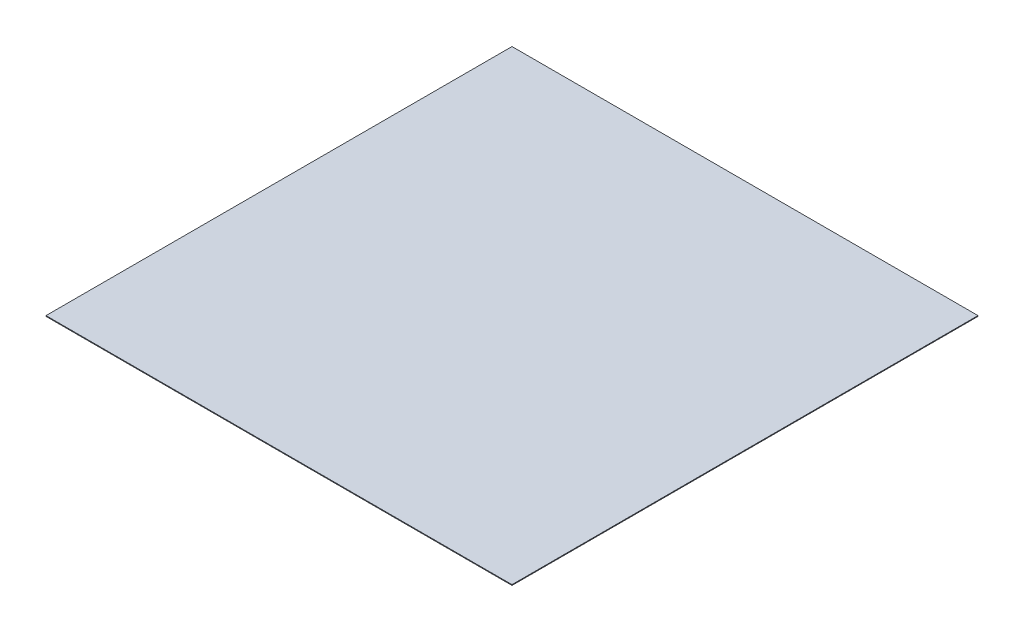
ISO-10303-21;
HEADER;
FILE_DESCRIPTION(('STEP AP214'),'2;1');
FILE_NAME('part.step','',(''),(''),'','','');
FILE_SCHEMA(('AUTOMOTIVE_DESIGN { 1 0 10303 214 1 1 1 1 }'));
ENDSEC;
DATA;
#1=APPLICATION_CONTEXT('core data for automotive mechanical design processes');
#2=APPLICATION_PROTOCOL_DEFINITION('international standard','automotive_design',2000,#1);
#3=PRODUCT_CONTEXT('',#1,'mechanical');
#4=PRODUCT('Part','Part','',(#3));
#5=PRODUCT_RELATED_PRODUCT_CATEGORY('part','',(#4));
#6=PRODUCT_DEFINITION_FORMATION('','',#4);
#7=PRODUCT_DEFINITION_CONTEXT('part definition',#1,'design');
#8=PRODUCT_DEFINITION('design','',#6,#7);
#9=PRODUCT_DEFINITION_SHAPE('','',#8);
#10=(LENGTH_UNIT() NAMED_UNIT(*) SI_UNIT(.MILLI.,.METRE.));
#11=(NAMED_UNIT(*) PLANE_ANGLE_UNIT() SI_UNIT($,.RADIAN.));
#12=(NAMED_UNIT(*) SI_UNIT($,.STERADIAN.) SOLID_ANGLE_UNIT());
#13=UNCERTAINTY_MEASURE_WITH_UNIT(LENGTH_MEASURE(1.E-05),#10,'distance_accuracy_value','');
#14=(GEOMETRIC_REPRESENTATION_CONTEXT(3) GLOBAL_UNCERTAINTY_ASSIGNED_CONTEXT((#13)) GLOBAL_UNIT_ASSIGNED_CONTEXT((#10,
#11,#12)) REPRESENTATION_CONTEXT('',''));
#15=CARTESIAN_POINT('',(0.,0.,0.));
#16=DIRECTION('',(0.,0.,1.));
#17=DIRECTION('',(1.,0.,0.));
#18=AXIS2_PLACEMENT_3D('',#15,#16,#17);
#19=CARTESIAN_POINT('',(0.,0.5,0.));
#20=DIRECTION('',(1.,0.,0.));
#21=DIRECTION('',(0.,0.,-1.));
#22=AXIS2_PLACEMENT_3D('',#19,#20,#21);
#23=PLANE('',#22);
#24=DIRECTION('',(0.,0.,1.));
#25=VECTOR('',#24,1.);
#26=CARTESIAN_POINT('',(0.,0.,0.));
#27=LINE('',#26,#25);
#28=CARTESIAN_POINT('',(0.,0.,-320.));
#29=VERTEX_POINT('',#28);
#30=CARTESIAN_POINT('',(0.,0.,0.));
#31=VERTEX_POINT('',#30);
#32=EDGE_CURVE('E98',#29,#31,#27,.T.);
#33=ORIENTED_EDGE('',*,*,#32,.T.);
#34=DIRECTION('',(0.,-1.,0.));
#35=VECTOR('',#34,1.);
#36=CARTESIAN_POINT('',(0.,0.5,0.));
#37=LINE('',#36,#35);
#38=CARTESIAN_POINT('',(0.,0.5,0.));
#39=VERTEX_POINT('',#38);
#40=EDGE_CURVE('E11',#39,#31,#37,.T.);
#41=ORIENTED_EDGE('',*,*,#40,.F.);
#42=DIRECTION('',(0.,0.,1.));
#43=VECTOR('',#42,1.);
#44=CARTESIAN_POINT('',(0.,0.5,0.));
#45=LINE('',#44,#43);
#46=CARTESIAN_POINT('',(0.,0.5,-320.));
#47=VERTEX_POINT('',#46);
#48=EDGE_CURVE('E86',#47,#39,#45,.T.);
#49=ORIENTED_EDGE('',*,*,#48,.F.);
#50=DIRECTION('',(0.,-1.,0.));
#51=VECTOR('',#50,1.);
#52=CARTESIAN_POINT('',(0.,0.5,-320.));
#53=LINE('',#52,#51);
#54=EDGE_CURVE('E94',#47,#29,#53,.T.);
#55=ORIENTED_EDGE('',*,*,#54,.T.);
#56=EDGE_LOOP('',(#33,#41,#49,#55));
#57=FACE_BOUND('',#56,.T.);
#58=ADVANCED_FACE('F35',(#57),#23,.F.);
#59=CARTESIAN_POINT('',(0.,0.5,0.));
#60=DIRECTION('',(0.,0.,-1.));
#61=DIRECTION('',(-1.,0.,0.));
#62=AXIS2_PLACEMENT_3D('',#59,#60,#61);
#63=PLANE('',#62);
#64=DIRECTION('',(1.,0.,0.));
#65=VECTOR('',#64,1.);
#66=CARTESIAN_POINT('',(0.,0.,0.));
#67=LINE('',#66,#65);
#68=CARTESIAN_POINT('',(320.,0.,0.));
#69=VERTEX_POINT('',#68);
#70=EDGE_CURVE('E90',#31,#69,#67,.T.);
#71=ORIENTED_EDGE('',*,*,#70,.T.);
#72=DIRECTION('',(0.,-1.,0.));
#73=VECTOR('',#72,1.);
#74=CARTESIAN_POINT('',(320.,0.5,0.));
#75=LINE('',#74,#73);
#76=CARTESIAN_POINT('',(320.,0.5,0.));
#77=VERTEX_POINT('',#76);
#78=EDGE_CURVE('E43',#77,#69,#75,.T.);
#79=ORIENTED_EDGE('',*,*,#78,.F.);
#80=DIRECTION('',(1.,0.,0.));
#81=VECTOR('',#80,1.);
#82=CARTESIAN_POINT('',(0.,0.5,0.));
#83=LINE('',#82,#81);
#84=EDGE_CURVE('E81',#39,#77,#83,.T.);
#85=ORIENTED_EDGE('',*,*,#84,.F.);
#86=ORIENTED_EDGE('',*,*,#40,.T.);
#87=EDGE_LOOP('',(#71,#79,#85,#86));
#88=FACE_BOUND('',#87,.T.);
#89=ADVANCED_FACE('F89',(#88),#63,.F.);
#90=CARTESIAN_POINT('',(320.,0.5,0.));
#91=DIRECTION('',(-1.,0.,0.));
#92=DIRECTION('',(0.,0.,1.));
#93=AXIS2_PLACEMENT_3D('',#90,#91,#92);
#94=PLANE('',#93);
#95=DIRECTION('',(0.,0.,-1.));
#96=VECTOR('',#95,1.);
#97=CARTESIAN_POINT('',(320.,0.,0.));
#98=LINE('',#97,#96);
#99=CARTESIAN_POINT('',(320.,0.,-320.));
#100=VERTEX_POINT('',#99);
#101=EDGE_CURVE('E68',#69,#100,#98,.T.);
#102=ORIENTED_EDGE('',*,*,#101,.T.);
#103=DIRECTION('',(0.,-1.,0.));
#104=VECTOR('',#103,1.);
#105=CARTESIAN_POINT('',(320.,0.5,-320.));
#106=LINE('',#105,#104);
#107=CARTESIAN_POINT('',(320.,0.5,-320.));
#108=VERTEX_POINT('',#107);
#109=EDGE_CURVE('E91',#108,#100,#106,.T.);
#110=ORIENTED_EDGE('',*,*,#109,.F.);
#111=DIRECTION('',(0.,0.,-1.));
#112=VECTOR('',#111,1.);
#113=CARTESIAN_POINT('',(320.,0.5,0.));
#114=LINE('',#113,#112);
#115=EDGE_CURVE('E84',#77,#108,#114,.T.);
#116=ORIENTED_EDGE('',*,*,#115,.F.);
#117=ORIENTED_EDGE('',*,*,#78,.T.);
#118=EDGE_LOOP('',(#102,#110,#116,#117));
#119=FACE_BOUND('',#118,.T.);
#120=ADVANCED_FACE('F92',(#119),#94,.F.);
#121=CARTESIAN_POINT('',(0.,0.5,-320.));
#122=DIRECTION('',(0.,0.,1.));
#123=DIRECTION('',(1.,0.,0.));
#124=AXIS2_PLACEMENT_3D('',#121,#122,#123);
#125=PLANE('',#124);
#126=DIRECTION('',(-1.,0.,0.));
#127=VECTOR('',#126,1.);
#128=CARTESIAN_POINT('',(0.,0.,-320.));
#129=LINE('',#128,#127);
#130=EDGE_CURVE('E74',#100,#29,#129,.T.);
#131=ORIENTED_EDGE('',*,*,#130,.T.);
#132=ORIENTED_EDGE('',*,*,#54,.F.);
#133=DIRECTION('',(-1.,0.,0.));
#134=VECTOR('',#133,1.);
#135=CARTESIAN_POINT('',(0.,0.5,-320.));
#136=LINE('',#135,#134);
#137=EDGE_CURVE('E51',#108,#47,#136,.T.);
#138=ORIENTED_EDGE('',*,*,#137,.F.);
#139=ORIENTED_EDGE('',*,*,#109,.T.);
#140=EDGE_LOOP('',(#131,#132,#138,#139));
#141=FACE_BOUND('',#140,.T.);
#142=ADVANCED_FACE('F105',(#141),#125,.F.);
#143=CARTESIAN_POINT('',(0.,0.5,0.));
#144=DIRECTION('',(0.,-1.,0.));
#145=DIRECTION('',(0.,0.,-1.));
#146=AXIS2_PLACEMENT_3D('',#143,#144,#145);
#147=PLANE('',#146);
#148=ORIENTED_EDGE('',*,*,#48,.T.);
#149=ORIENTED_EDGE('',*,*,#84,.T.);
#150=ORIENTED_EDGE('',*,*,#115,.T.);
#151=ORIENTED_EDGE('',*,*,#137,.T.);
#152=EDGE_LOOP('',(#148,#149,#150,#151));
#153=FACE_BOUND('',#152,.T.);
#154=ADVANCED_FACE('F82',(#153),#147,.F.);
#155=CARTESIAN_POINT('',(0.,0.,0.));
#156=DIRECTION('',(0.,-1.,0.));
#157=DIRECTION('',(0.,0.,-1.));
#158=AXIS2_PLACEMENT_3D('',#155,#156,#157);
#159=PLANE('',#158);
#160=ORIENTED_EDGE('',*,*,#32,.F.);
#161=ORIENTED_EDGE('',*,*,#130,.F.);
#162=ORIENTED_EDGE('',*,*,#101,.F.);
#163=ORIENTED_EDGE('',*,*,#70,.F.);
#164=EDGE_LOOP('',(#160,#161,#162,#163));
#165=FACE_BOUND('',#164,.T.);
#166=ADVANCED_FACE('F108',(#165),#159,.T.);
#167=CLOSED_SHELL('',(#58,#89,#120,#142,#154,#166));
#168=MANIFOLD_SOLID_BREP('B2',#167);
#169=ADVANCED_BREP_SHAPE_REPRESENTATION('',(#18,#168),#14);
#170=SHAPE_DEFINITION_REPRESENTATION(#9,#169);
ENDSEC;
END-ISO-10303-21;
